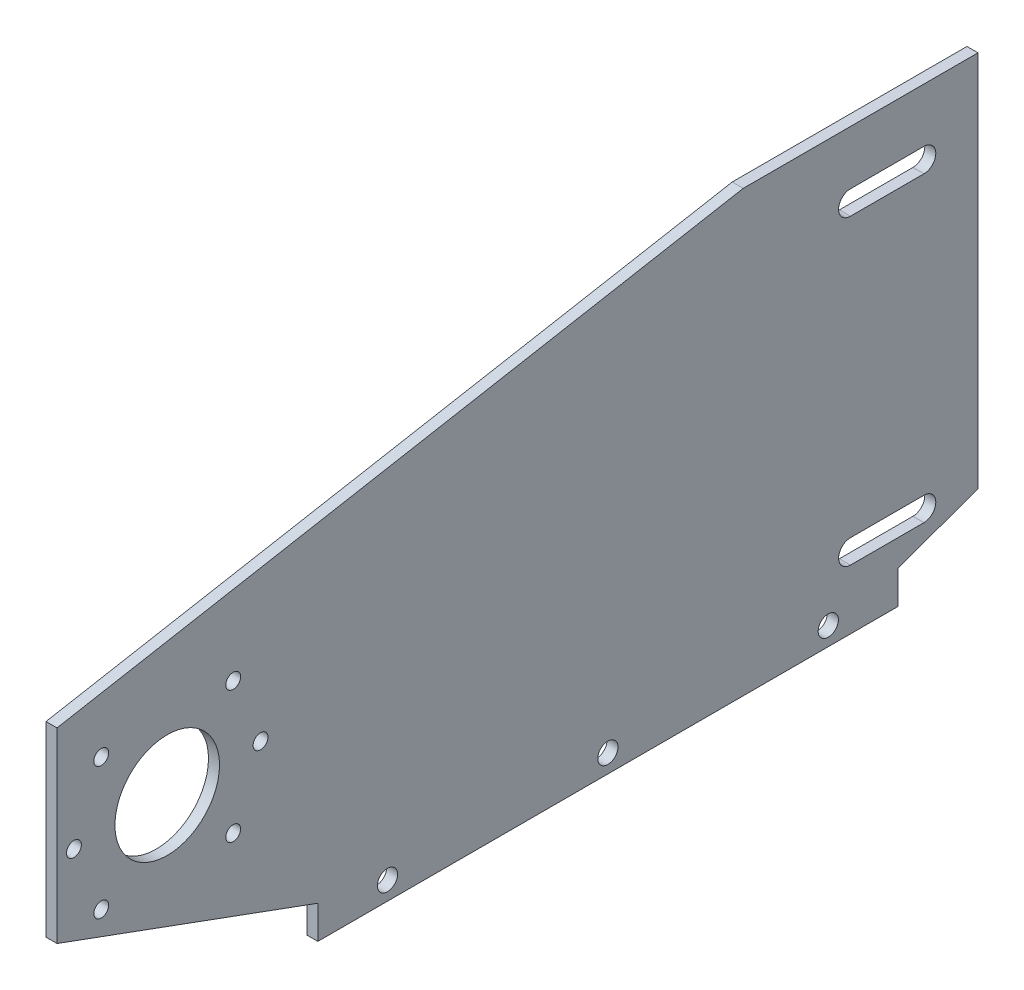
ISO-10303-21;
HEADER;
FILE_DESCRIPTION(('STEP AP214'),'2;1');
FILE_NAME('part.step','',(''),(''),'','','');
FILE_SCHEMA(('AUTOMOTIVE_DESIGN { 1 0 10303 214 1 1 1 1 }'));
ENDSEC;
DATA;
#1=APPLICATION_CONTEXT('core data for automotive mechanical design processes');
#2=APPLICATION_PROTOCOL_DEFINITION('international standard','automotive_design',2000,#1);
#3=PRODUCT_CONTEXT('',#1,'mechanical');
#4=PRODUCT('Part','Part','',(#3));
#5=PRODUCT_RELATED_PRODUCT_CATEGORY('part','',(#4));
#6=PRODUCT_DEFINITION_FORMATION('','',#4);
#7=PRODUCT_DEFINITION_CONTEXT('part definition',#1,'design');
#8=PRODUCT_DEFINITION('design','',#6,#7);
#9=PRODUCT_DEFINITION_SHAPE('','',#8);
#10=(LENGTH_UNIT() NAMED_UNIT(*) SI_UNIT(.MILLI.,.METRE.));
#11=(NAMED_UNIT(*) PLANE_ANGLE_UNIT() SI_UNIT($,.RADIAN.));
#12=(NAMED_UNIT(*) SI_UNIT($,.STERADIAN.) SOLID_ANGLE_UNIT());
#13=UNCERTAINTY_MEASURE_WITH_UNIT(LENGTH_MEASURE(1.E-05),#10,'distance_accuracy_value','');
#14=(GEOMETRIC_REPRESENTATION_CONTEXT(3) GLOBAL_UNCERTAINTY_ASSIGNED_CONTEXT((#13)) GLOBAL_UNIT_ASSIGNED_CONTEXT((#10,
#11,#12)) REPRESENTATION_CONTEXT('',''));
#15=CARTESIAN_POINT('',(0.,0.,0.));
#16=DIRECTION('',(0.,0.,1.));
#17=DIRECTION('',(1.,0.,0.));
#18=AXIS2_PLACEMENT_3D('',#15,#16,#17);
#19=CARTESIAN_POINT('',(3.,0.,0.));
#20=DIRECTION('',(0.,1.,0.));
#21=DIRECTION('',(0.,0.,1.));
#22=AXIS2_PLACEMENT_3D('',#19,#20,#21);
#23=PLANE('',#22);
#24=DIRECTION('',(-1.,0.,0.));
#25=VECTOR('',#24,1.);
#26=CARTESIAN_POINT('',(10.,0.,-228.924032369998));
#27=LINE('',#26,#25);
#28=CARTESIAN_POINT('',(3.,0.,-228.924032369998));
#29=VERTEX_POINT('',#28);
#30=CARTESIAN_POINT('',(0.,0.,-228.924032369998));
#31=VERTEX_POINT('',#30);
#32=EDGE_CURVE('E168',#29,#31,#27,.T.);
#33=ORIENTED_EDGE('',*,*,#32,.F.);
#34=DIRECTION('',(0.,0.,-1.));
#35=VECTOR('',#34,1.);
#36=CARTESIAN_POINT('',(3.,0.,0.));
#37=LINE('',#36,#35);
#38=CARTESIAN_POINT('',(3.,-1.04083408558608E-13,-71.0000000000003));
#39=VERTEX_POINT('',#38);
#40=EDGE_CURVE('E190',#39,#29,#37,.T.);
#41=ORIENTED_EDGE('',*,*,#40,.F.);
#42=DIRECTION('',(-1.,0.,0.));
#43=VECTOR('',#42,1.);
#44=CARTESIAN_POINT('',(3.,-1.04083408558608E-13,-71.0000000000003));
#45=LINE('',#44,#43);
#46=CARTESIAN_POINT('',(0.,0.,-71.0000000000003));
#47=VERTEX_POINT('',#46);
#48=EDGE_CURVE('E204',#39,#47,#45,.T.);
#49=ORIENTED_EDGE('',*,*,#48,.T.);
#50=DIRECTION('',(0.,0.,-1.));
#51=VECTOR('',#50,1.);
#52=CARTESIAN_POINT('',(0.,0.,0.));
#53=LINE('',#52,#51);
#54=EDGE_CURVE('E328',#47,#31,#53,.T.);
#55=ORIENTED_EDGE('',*,*,#54,.T.);
#56=EDGE_LOOP('',(#33,#41,#49,#55));
#57=FACE_BOUND('',#56,.T.);
#58=ADVANCED_FACE('F39',(#57),#23,.F.);
#59=CARTESIAN_POINT('',(3.,0.,0.));
#60=DIRECTION('',(-1.,0.,0.));
#61=DIRECTION('',(0.,0.,1.));
#62=AXIS2_PLACEMENT_3D('',#59,#60,#61);
#63=PLANE('',#62);
#64=CARTESIAN_POINT('',(3.,5.,-89.9620161849994));
#65=DIRECTION('',(1.,0.,0.));
#66=DIRECTION('',(0.,0.,-1.));
#67=AXIS2_PLACEMENT_3D('',#64,#65,#66);
#68=CIRCLE('',#67,2.74999999999961);
#69=CARTESIAN_POINT('',(3.,5.,-92.712016184999));
#70=VERTEX_POINT('',#69);
#71=EDGE_CURVE('E603',#70,#70,#68,.T.);
#72=ORIENTED_EDGE('',*,*,#71,.F.);
#73=EDGE_LOOP('',(#72));
#74=FACE_BOUND('',#73,.T.);
#75=CARTESIAN_POINT('',(3.,5.,-149.962016184999));
#76=DIRECTION('',(1.,0.,0.));
#77=DIRECTION('',(0.,0.,-1.));
#78=AXIS2_PLACEMENT_3D('',#75,#76,#77);
#79=CIRCLE('',#78,2.74999999999964);
#80=CARTESIAN_POINT('',(3.,5.,-152.712016184999));
#81=VERTEX_POINT('',#80);
#82=EDGE_CURVE('E606',#81,#81,#79,.T.);
#83=ORIENTED_EDGE('',*,*,#82,.F.);
#84=EDGE_LOOP('',(#83));
#85=FACE_BOUND('',#84,.T.);
#86=CARTESIAN_POINT('',(3.,4.99999999999995,-209.962016184999));
#87=DIRECTION('',(1.,0.,0.));
#88=DIRECTION('',(0.,0.,-1.));
#89=AXIS2_PLACEMENT_3D('',#86,#87,#88);
#90=CIRCLE('',#89,2.74999999999964);
#91=CARTESIAN_POINT('',(3.,4.99999999999995,-212.712016184999));
#92=VERTEX_POINT('',#91);
#93=EDGE_CURVE('E611',#92,#92,#90,.T.);
#94=ORIENTED_EDGE('',*,*,#93,.F.);
#95=EDGE_LOOP('',(#94));
#96=FACE_BOUND('',#95,.T.);
#97=CARTESIAN_POINT('',(3.,55.,-30.));
#98=DIRECTION('',(1.,0.,0.));
#99=DIRECTION('',(0.,0.,-1.));
#100=AXIS2_PLACEMENT_3D('',#97,#98,#99);
#101=CIRCLE('',#100,14.235);
#102=CARTESIAN_POINT('',(3.,55.,-44.235));
#103=VERTEX_POINT('',#102);
#104=EDGE_CURVE('E316',#103,#103,#101,.T.);
#105=ORIENTED_EDGE('',*,*,#104,.F.);
#106=EDGE_LOOP('',(#105));
#107=FACE_BOUND('',#106,.T.);
#108=DIRECTION('',(0.,0.,1.));
#109=VECTOR('',#108,1.);
#110=CARTESIAN_POINT('',(3.,104.938413591154,-236.));
#111=LINE('',#110,#109);
#112=CARTESIAN_POINT('',(3.,104.938413591154,-236.));
#113=VERTEX_POINT('',#112);
#114=CARTESIAN_POINT('',(3.,104.938413591154,-216.));
#115=VERTEX_POINT('',#114);
#116=EDGE_CURVE('E290',#113,#115,#111,.T.);
#117=ORIENTED_EDGE('',*,*,#116,.F.);
#118=CARTESIAN_POINT('',(3.,101.708413591154,-236.));
#119=DIRECTION('',(-1.,0.,0.));
#120=DIRECTION('',(0.,0.,1.));
#121=AXIS2_PLACEMENT_3D('',#118,#119,#120);
#122=CIRCLE('',#121,3.22999999999997);
#123=CARTESIAN_POINT('',(3.,98.4784135911545,-236.));
#124=VERTEX_POINT('',#123);
#125=EDGE_CURVE('E292',#124,#113,#122,.F.);
#126=ORIENTED_EDGE('',*,*,#125,.F.);
#127=DIRECTION('',(0.,0.,-1.));
#128=VECTOR('',#127,1.);
#129=CARTESIAN_POINT('',(3.,98.4784135911545,-216.));
#130=LINE('',#129,#128);
#131=CARTESIAN_POINT('',(3.,98.4784135911545,-216.));
#132=VERTEX_POINT('',#131);
#133=EDGE_CURVE('E307',#132,#124,#130,.T.);
#134=ORIENTED_EDGE('',*,*,#133,.F.);
#135=CARTESIAN_POINT('',(3.,101.708413591154,-216.));
#136=DIRECTION('',(-1.,0.,0.));
#137=DIRECTION('',(0.,0.,1.));
#138=AXIS2_PLACEMENT_3D('',#135,#136,#137);
#139=CIRCLE('',#138,3.22999999999997);
#140=EDGE_CURVE('E289',#115,#132,#139,.F.);
#141=ORIENTED_EDGE('',*,*,#140,.F.);
#142=EDGE_LOOP('',(#117,#126,#134,#141));
#143=FACE_BOUND('',#142,.T.);
#144=DIRECTION('',(0.,0.,-1.));
#145=VECTOR('',#144,1.);
#146=CARTESIAN_POINT('',(3.,16.2316943557674,-216.));
#147=LINE('',#146,#145);
#148=CARTESIAN_POINT('',(3.,16.2316943557674,-216.));
#149=VERTEX_POINT('',#148);
#150=CARTESIAN_POINT('',(3.,16.2316943557674,-236.));
#151=VERTEX_POINT('',#150);
#152=EDGE_CURVE('E285',#149,#151,#147,.T.);
#153=ORIENTED_EDGE('',*,*,#152,.F.);
#154=CARTESIAN_POINT('',(3.,19.4566943557674,-216.));
#155=DIRECTION('',(-1.,0.,0.));
#156=DIRECTION('',(0.,0.,1.));
#157=AXIS2_PLACEMENT_3D('',#154,#155,#156);
#158=CIRCLE('',#157,3.225);
#159=CARTESIAN_POINT('',(3.,22.6816943557674,-216.));
#160=VERTEX_POINT('',#159);
#161=EDGE_CURVE('E276',#160,#149,#158,.F.);
#162=ORIENTED_EDGE('',*,*,#161,.F.);
#163=DIRECTION('',(0.,0.,1.));
#164=VECTOR('',#163,1.);
#165=CARTESIAN_POINT('',(3.,22.6816943557674,-236.));
#166=LINE('',#165,#164);
#167=CARTESIAN_POINT('',(3.,22.6816943557674,-236.));
#168=VERTEX_POINT('',#167);
#169=EDGE_CURVE('E251',#168,#160,#166,.T.);
#170=ORIENTED_EDGE('',*,*,#169,.F.);
#171=CARTESIAN_POINT('',(3.,19.4566943557674,-236.));
#172=DIRECTION('',(-1.,0.,0.));
#173=DIRECTION('',(0.,0.,1.));
#174=AXIS2_PLACEMENT_3D('',#171,#172,#173);
#175=CIRCLE('',#174,3.225);
#176=EDGE_CURVE('E284',#151,#168,#175,.F.);
#177=ORIENTED_EDGE('',*,*,#176,.F.);
#178=EDGE_LOOP('',(#153,#162,#170,#177));
#179=FACE_BOUND('',#178,.T.);
#180=CARTESIAN_POINT('',(3.,37.0394877578616,-12.039487757861));
#181=DIRECTION('',(1.,0.,0.));
#182=DIRECTION('',(0.,0.,-1.));
#183=AXIS2_PLACEMENT_3D('',#180,#181,#182);
#184=CIRCLE('',#183,2.01930000000095);
#185=CARTESIAN_POINT('',(3.,37.0394877578616,-14.058787757862));
#186=VERTEX_POINT('',#185);
#187=EDGE_CURVE('E229',#186,#186,#184,.T.);
#188=ORIENTED_EDGE('',*,*,#187,.F.);
#189=EDGE_LOOP('',(#188));
#190=FACE_BOUND('',#189,.T.);
#191=CARTESIAN_POINT('',(3.,72.9605122421384,-47.9605122421375));
#192=DIRECTION('',(1.,0.,0.));
#193=DIRECTION('',(0.,0.,-1.));
#194=AXIS2_PLACEMENT_3D('',#191,#192,#193);
#195=CIRCLE('',#194,2.0193000000009);
#196=CARTESIAN_POINT('',(3.,72.9605122421384,-49.9798122421384));
#197=VERTEX_POINT('',#196);
#198=EDGE_CURVE('E223',#197,#197,#195,.T.);
#199=ORIENTED_EDGE('',*,*,#198,.F.);
#200=EDGE_LOOP('',(#199));
#201=FACE_BOUND('',#200,.T.);
#202=CARTESIAN_POINT('',(3.,55.,-55.3999999999992));
#203=DIRECTION('',(1.,0.,0.));
#204=DIRECTION('',(0.,0.,-1.));
#205=AXIS2_PLACEMENT_3D('',#202,#203,#204);
#206=CIRCLE('',#205,2.01930000000093);
#207=CARTESIAN_POINT('',(3.,55.,-57.4193000000002));
#208=VERTEX_POINT('',#207);
#209=EDGE_CURVE('E246',#208,#208,#206,.T.);
#210=ORIENTED_EDGE('',*,*,#209,.F.);
#211=EDGE_LOOP('',(#210));
#212=FACE_BOUND('',#211,.T.);
#213=CARTESIAN_POINT('',(3.,37.0394877578618,-47.9605122421376));
#214=DIRECTION('',(1.,0.,0.));
#215=DIRECTION('',(0.,0.,-1.));
#216=AXIS2_PLACEMENT_3D('',#213,#214,#215);
#217=CIRCLE('',#216,2.01930000000096);
#218=CARTESIAN_POINT('',(3.,37.0394877578618,-49.9798122421386));
#219=VERTEX_POINT('',#218);
#220=EDGE_CURVE('E239',#219,#219,#217,.T.);
#221=ORIENTED_EDGE('',*,*,#220,.F.);
#222=EDGE_LOOP('',(#221));
#223=FACE_BOUND('',#222,.T.);
#224=CARTESIAN_POINT('',(3.,55.,-4.59999999999925));
#225=DIRECTION('',(1.,0.,0.));
#226=DIRECTION('',(0.,0.,-1.));
#227=AXIS2_PLACEMENT_3D('',#224,#225,#226);
#228=CIRCLE('',#227,2.01930000000091);
#229=CARTESIAN_POINT('',(3.,55.,-6.61930000000016));
#230=VERTEX_POINT('',#229);
#231=EDGE_CURVE('E234',#230,#230,#228,.T.);
#232=ORIENTED_EDGE('',*,*,#231,.F.);
#233=EDGE_LOOP('',(#232));
#234=FACE_BOUND('',#233,.T.);
#235=CARTESIAN_POINT('',(3.,72.9605122421382,-12.0394877578609));
#236=DIRECTION('',(1.,0.,0.));
#237=DIRECTION('',(0.,0.,-1.));
#238=AXIS2_PLACEMENT_3D('',#235,#236,#237);
#239=CIRCLE('',#238,2.01930000000089);
#240=CARTESIAN_POINT('',(3.,72.9605122421382,-14.0587877578618));
#241=VERTEX_POINT('',#240);
#242=EDGE_CURVE('E227',#241,#241,#239,.T.);
#243=ORIENTED_EDGE('',*,*,#242,.F.);
#244=EDGE_LOOP('',(#243));
#245=FACE_BOUND('',#244,.T.);
#246=DIRECTION('',(0.,-1.,1.11022302462517E-13));
#247=VECTOR('',#246,1.);
#248=CARTESIAN_POINT('',(3.,-2.5415673162721E-11,-228.924032369998));
#249=LINE('',#248,#247);
#250=CARTESIAN_POINT('',(3.,8.99999999999977,-228.924032369999));
#251=VERTEX_POINT('',#250);
#252=EDGE_CURVE('E11',#251,#29,#249,.T.);
#253=ORIENTED_EDGE('',*,*,#252,.F.);
#254=DIRECTION('',(0.,-0.339870380460165,0.940472287994635));
#255=VECTOR('',#254,1.);
#256=CARTESIAN_POINT('',(3.,-65.2125811093336,-23.5666962603209));
#257=LINE('',#256,#255);
#258=CARTESIAN_POINT('',(3.,16.8759471545118,-250.717958720686));
#259=VERTEX_POINT('',#258);
#260=EDGE_CURVE('E183',#259,#251,#257,.T.);
#261=ORIENTED_EDGE('',*,*,#260,.F.);
#262=DIRECTION('',(0.,-1.,0.));
#263=VECTOR('',#262,1.);
#264=CARTESIAN_POINT('',(3.,8.41583918198635E-13,-250.717958720686));
#265=LINE('',#264,#263);
#266=CARTESIAN_POINT('',(3.,119.641480315501,-250.717958720685));
#267=VERTEX_POINT('',#266);
#268=EDGE_CURVE('E50',#267,#259,#265,.T.);
#269=ORIENTED_EDGE('',*,*,#268,.F.);
#270=DIRECTION('',(0.,0.,1.));
#271=VECTOR('',#270,1.);
#272=CARTESIAN_POINT('',(3.,119.641480315501,-186.802640374282));
#273=LINE('',#272,#271);
#274=CARTESIAN_POINT('',(3.,119.641480315501,-186.802640374282));
#275=VERTEX_POINT('',#274);
#276=EDGE_CURVE('E216',#267,#275,#273,.T.);
#277=ORIENTED_EDGE('',*,*,#276,.T.);
#278=DIRECTION('',(0.,-0.178012042619946,0.984028308882562));
#279=VECTOR('',#278,1.);
#280=CARTESIAN_POINT('',(3.,85.8486317971625,-3.88578058618805E-13));
#281=LINE('',#280,#279);
#282=CARTESIAN_POINT('',(3.,85.8486317971625,-3.88578058618805E-13));
#283=VERTEX_POINT('',#282);
#284=EDGE_CURVE('E212',#275,#283,#281,.T.);
#285=ORIENTED_EDGE('',*,*,#284,.T.);
#286=DIRECTION('',(0.,-1.,0.));
#287=VECTOR('',#286,1.);
#288=CARTESIAN_POINT('',(3.,0.,0.));
#289=LINE('',#288,#287);
#290=CARTESIAN_POINT('',(3.,34.9999999999999,-2.22044604925031E-13));
#291=VERTEX_POINT('',#290);
#292=EDGE_CURVE('E323',#283,#291,#289,.T.);
#293=ORIENTED_EDGE('',*,*,#292,.T.);
#294=DIRECTION('',(0.,-0.343866011956347,-0.939018724957728));
#295=VECTOR('',#294,1.);
#296=CARTESIAN_POINT('',(3.,8.99999999999983,-71.0000000000012));
#297=LINE('',#296,#295);
#298=CARTESIAN_POINT('',(3.,8.99999999999983,-71.0000000000012));
#299=VERTEX_POINT('',#298);
#300=EDGE_CURVE('E192',#291,#299,#297,.T.);
#301=ORIENTED_EDGE('',*,*,#300,.T.);
#302=DIRECTION('',(0.,-1.,1.07938349616336E-13));
#303=VECTOR('',#302,1.);
#304=CARTESIAN_POINT('',(3.,-1.04083408558608E-13,-71.0000000000003));
#305=LINE('',#304,#303);
#306=EDGE_CURVE('E191',#299,#39,#305,.T.);
#307=ORIENTED_EDGE('',*,*,#306,.T.);
#308=ORIENTED_EDGE('',*,*,#40,.T.);
#309=EDGE_LOOP('',(#253,#261,#269,#277,#285,#293,#301,#307,#308));
#310=FACE_BOUND('',#309,.T.);
#311=ADVANCED_FACE('F347',(#74,#85,#96,#107,#143,#179,#190,#201,#212,#223,#234,#245,#310),#63,.F.);
#312=CARTESIAN_POINT('',(0.,0.,0.));
#313=DIRECTION('',(-1.,0.,0.));
#314=DIRECTION('',(0.,0.,1.));
#315=AXIS2_PLACEMENT_3D('',#312,#313,#314);
#316=PLANE('',#315);
#317=CARTESIAN_POINT('',(0.,5.,-89.9620161849994));
#318=DIRECTION('',(1.,0.,0.));
#319=DIRECTION('',(0.,0.,-1.));
#320=AXIS2_PLACEMENT_3D('',#317,#318,#319);
#321=CIRCLE('',#320,2.74999999999961);
#322=CARTESIAN_POINT('',(0.,5.,-92.712016184999));
#323=VERTEX_POINT('',#322);
#324=EDGE_CURVE('E173',#323,#323,#321,.T.);
#325=ORIENTED_EDGE('',*,*,#324,.T.);
#326=EDGE_LOOP('',(#325));
#327=FACE_BOUND('',#326,.T.);
#328=CARTESIAN_POINT('',(0.,5.,-149.962016184999));
#329=DIRECTION('',(1.,0.,0.));
#330=DIRECTION('',(0.,0.,-1.));
#331=AXIS2_PLACEMENT_3D('',#328,#329,#330);
#332=CIRCLE('',#331,2.74999999999964);
#333=CARTESIAN_POINT('',(0.,5.,-152.712016184999));
#334=VERTEX_POINT('',#333);
#335=EDGE_CURVE('E609',#334,#334,#332,.T.);
#336=ORIENTED_EDGE('',*,*,#335,.T.);
#337=EDGE_LOOP('',(#336));
#338=FACE_BOUND('',#337,.T.);
#339=CARTESIAN_POINT('',(0.,4.99999999999995,-209.962016184999));
#340=DIRECTION('',(1.,0.,0.));
#341=DIRECTION('',(0.,0.,-1.));
#342=AXIS2_PLACEMENT_3D('',#339,#340,#341);
#343=CIRCLE('',#342,2.74999999999964);
#344=CARTESIAN_POINT('',(0.,4.99999999999995,-212.712016184999));
#345=VERTEX_POINT('',#344);
#346=EDGE_CURVE('E617',#345,#345,#343,.T.);
#347=ORIENTED_EDGE('',*,*,#346,.T.);
#348=EDGE_LOOP('',(#347));
#349=FACE_BOUND('',#348,.T.);
#350=CARTESIAN_POINT('',(0.,72.9605122421382,-12.0394877578609));
#351=DIRECTION('',(1.,0.,0.));
#352=DIRECTION('',(0.,0.,-1.));
#353=AXIS2_PLACEMENT_3D('',#350,#351,#352);
#354=CIRCLE('',#353,2.01930000000089);
#355=CARTESIAN_POINT('',(0.,72.9605122421382,-14.0587877578618));
#356=VERTEX_POINT('',#355);
#357=EDGE_CURVE('E233',#356,#356,#354,.T.);
#358=ORIENTED_EDGE('',*,*,#357,.T.);
#359=EDGE_LOOP('',(#358));
#360=FACE_BOUND('',#359,.T.);
#361=CARTESIAN_POINT('',(0.,55.,-4.59999999999925));
#362=DIRECTION('',(1.,0.,0.));
#363=DIRECTION('',(0.,0.,-1.));
#364=AXIS2_PLACEMENT_3D('',#361,#362,#363);
#365=CIRCLE('',#364,2.01930000000091);
#366=CARTESIAN_POINT('',(0.,55.,-6.61930000000016));
#367=VERTEX_POINT('',#366);
#368=EDGE_CURVE('E240',#367,#367,#365,.T.);
#369=ORIENTED_EDGE('',*,*,#368,.T.);
#370=EDGE_LOOP('',(#369));
#371=FACE_BOUND('',#370,.T.);
#372=CARTESIAN_POINT('',(0.,37.0394877578618,-47.9605122421376));
#373=DIRECTION('',(1.,0.,0.));
#374=DIRECTION('',(0.,0.,-1.));
#375=AXIS2_PLACEMENT_3D('',#372,#373,#374);
#376=CIRCLE('',#375,2.01930000000096);
#377=CARTESIAN_POINT('',(0.,37.0394877578618,-49.9798122421386));
#378=VERTEX_POINT('',#377);
#379=EDGE_CURVE('E243',#378,#378,#376,.T.);
#380=ORIENTED_EDGE('',*,*,#379,.T.);
#381=EDGE_LOOP('',(#380));
#382=FACE_BOUND('',#381,.T.);
#383=CARTESIAN_POINT('',(0.,55.,-55.3999999999992));
#384=DIRECTION('',(1.,0.,0.));
#385=DIRECTION('',(0.,0.,-1.));
#386=AXIS2_PLACEMENT_3D('',#383,#384,#385);
#387=CIRCLE('',#386,2.01930000000093);
#388=CARTESIAN_POINT('',(0.,55.,-57.4193000000002));
#389=VERTEX_POINT('',#388);
#390=EDGE_CURVE('E225',#389,#389,#387,.T.);
#391=ORIENTED_EDGE('',*,*,#390,.T.);
#392=EDGE_LOOP('',(#391));
#393=FACE_BOUND('',#392,.T.);
#394=CARTESIAN_POINT('',(0.,72.9605122421384,-47.9605122421375));
#395=DIRECTION('',(1.,0.,0.));
#396=DIRECTION('',(0.,0.,-1.));
#397=AXIS2_PLACEMENT_3D('',#394,#395,#396);
#398=CIRCLE('',#397,2.0193000000009);
#399=CARTESIAN_POINT('',(0.,72.9605122421384,-49.9798122421384));
#400=VERTEX_POINT('',#399);
#401=EDGE_CURVE('E205',#400,#400,#398,.T.);
#402=ORIENTED_EDGE('',*,*,#401,.T.);
#403=EDGE_LOOP('',(#402));
#404=FACE_BOUND('',#403,.T.);
#405=CARTESIAN_POINT('',(0.,37.0394877578616,-12.039487757861));
#406=DIRECTION('',(1.,0.,0.));
#407=DIRECTION('',(0.,0.,-1.));
#408=AXIS2_PLACEMENT_3D('',#405,#406,#407);
#409=CIRCLE('',#408,2.01930000000095);
#410=CARTESIAN_POINT('',(0.,37.0394877578616,-14.058787757862));
#411=VERTEX_POINT('',#410);
#412=EDGE_CURVE('E252',#411,#411,#409,.T.);
#413=ORIENTED_EDGE('',*,*,#412,.T.);
#414=EDGE_LOOP('',(#413));
#415=FACE_BOUND('',#414,.T.);
#416=CARTESIAN_POINT('',(0.,19.4566943557674,-216.));
#417=DIRECTION('',(-1.,0.,0.));
#418=DIRECTION('',(0.,0.,1.));
#419=AXIS2_PLACEMENT_3D('',#416,#417,#418);
#420=CIRCLE('',#419,3.225);
#421=CARTESIAN_POINT('',(0.,16.2316943557674,-216.));
#422=VERTEX_POINT('',#421);
#423=CARTESIAN_POINT('',(0.,22.6816943557674,-216.));
#424=VERTEX_POINT('',#423);
#425=EDGE_CURVE('E279',#422,#424,#420,.T.);
#426=ORIENTED_EDGE('',*,*,#425,.F.);
#427=DIRECTION('',(0.,0.,1.));
#428=VECTOR('',#427,1.);
#429=CARTESIAN_POINT('',(0.,16.2316943557674,-216.));
#430=LINE('',#429,#428);
#431=CARTESIAN_POINT('',(0.,16.2316943557674,-236.));
#432=VERTEX_POINT('',#431);
#433=EDGE_CURVE('E263',#432,#422,#430,.T.);
#434=ORIENTED_EDGE('',*,*,#433,.F.);
#435=CARTESIAN_POINT('',(0.,19.4566943557674,-236.));
#436=DIRECTION('',(-1.,0.,0.));
#437=DIRECTION('',(0.,0.,1.));
#438=AXIS2_PLACEMENT_3D('',#435,#436,#437);
#439=CIRCLE('',#438,3.225);
#440=CARTESIAN_POINT('',(0.,22.6816943557674,-236.));
#441=VERTEX_POINT('',#440);
#442=EDGE_CURVE('E272',#441,#432,#439,.T.);
#443=ORIENTED_EDGE('',*,*,#442,.F.);
#444=DIRECTION('',(0.,0.,-1.));
#445=VECTOR('',#444,1.);
#446=CARTESIAN_POINT('',(0.,22.6816943557674,-236.));
#447=LINE('',#446,#445);
#448=EDGE_CURVE('E274',#424,#441,#447,.T.);
#449=ORIENTED_EDGE('',*,*,#448,.F.);
#450=EDGE_LOOP('',(#426,#434,#443,#449));
#451=FACE_BOUND('',#450,.T.);
#452=CARTESIAN_POINT('',(0.,101.708413591154,-236.));
#453=DIRECTION('',(-1.,0.,0.));
#454=DIRECTION('',(0.,0.,1.));
#455=AXIS2_PLACEMENT_3D('',#452,#453,#454);
#456=CIRCLE('',#455,3.22999999999997);
#457=CARTESIAN_POINT('',(0.,104.938413591154,-236.));
#458=VERTEX_POINT('',#457);
#459=CARTESIAN_POINT('',(0.,98.4784135911545,-236.));
#460=VERTEX_POINT('',#459);
#461=EDGE_CURVE('E294',#458,#460,#456,.T.);
#462=ORIENTED_EDGE('',*,*,#461,.F.);
#463=DIRECTION('',(0.,0.,-1.));
#464=VECTOR('',#463,1.);
#465=CARTESIAN_POINT('',(0.,104.938413591154,-236.));
#466=LINE('',#465,#464);
#467=CARTESIAN_POINT('',(0.,104.938413591154,-216.));
#468=VERTEX_POINT('',#467);
#469=EDGE_CURVE('E303',#468,#458,#466,.T.);
#470=ORIENTED_EDGE('',*,*,#469,.F.);
#471=CARTESIAN_POINT('',(0.,101.708413591154,-216.));
#472=DIRECTION('',(-1.,0.,0.));
#473=DIRECTION('',(0.,0.,1.));
#474=AXIS2_PLACEMENT_3D('',#471,#472,#473);
#475=CIRCLE('',#474,3.22999999999997);
#476=CARTESIAN_POINT('',(0.,98.4784135911545,-216.));
#477=VERTEX_POINT('',#476);
#478=EDGE_CURVE('E297',#477,#468,#475,.T.);
#479=ORIENTED_EDGE('',*,*,#478,.F.);
#480=DIRECTION('',(0.,0.,1.));
#481=VECTOR('',#480,1.);
#482=CARTESIAN_POINT('',(0.,98.4784135911545,-216.));
#483=LINE('',#482,#481);
#484=EDGE_CURVE('E300',#460,#477,#483,.T.);
#485=ORIENTED_EDGE('',*,*,#484,.F.);
#486=EDGE_LOOP('',(#462,#470,#479,#485));
#487=FACE_BOUND('',#486,.T.);
#488=CARTESIAN_POINT('',(0.,55.,-30.));
#489=DIRECTION('',(1.,0.,0.));
#490=DIRECTION('',(0.,0.,-1.));
#491=AXIS2_PLACEMENT_3D('',#488,#489,#490);
#492=CIRCLE('',#491,14.235);
#493=CARTESIAN_POINT('',(0.,55.,-44.235));
#494=VERTEX_POINT('',#493);
#495=EDGE_CURVE('E319',#494,#494,#492,.T.);
#496=ORIENTED_EDGE('',*,*,#495,.T.);
#497=EDGE_LOOP('',(#496));
#498=FACE_BOUND('',#497,.T.);
#499=DIRECTION('',(0.,0.,1.));
#500=VECTOR('',#499,1.);
#501=CARTESIAN_POINT('',(0.,119.641480315501,-186.802640374282));
#502=LINE('',#501,#500);
#503=CARTESIAN_POINT('',(0.,119.641480315501,-250.717958720685));
#504=VERTEX_POINT('',#503);
#505=CARTESIAN_POINT('',(0.,119.641480315501,-186.802640374282));
#506=VERTEX_POINT('',#505);
#507=EDGE_CURVE('E178',#504,#506,#502,.T.);
#508=ORIENTED_EDGE('',*,*,#507,.F.);
#509=DIRECTION('',(0.,-1.,0.));
#510=VECTOR('',#509,1.);
#511=CARTESIAN_POINT('',(0.,8.41583918198635E-13,-250.717958720686));
#512=LINE('',#511,#510);
#513=CARTESIAN_POINT('',(0.,16.8759471545118,-250.717958720686));
#514=VERTEX_POINT('',#513);
#515=EDGE_CURVE('E163',#504,#514,#512,.T.);
#516=ORIENTED_EDGE('',*,*,#515,.T.);
#517=DIRECTION('',(0.,-0.339870380460165,0.940472287994635));
#518=VECTOR('',#517,1.);
#519=CARTESIAN_POINT('',(0.,-65.2125811093336,-23.5666962603209));
#520=LINE('',#519,#518);
#521=CARTESIAN_POINT('',(0.,8.99999999999977,-228.924032369999));
#522=VERTEX_POINT('',#521);
#523=EDGE_CURVE('E169',#514,#522,#520,.T.);
#524=ORIENTED_EDGE('',*,*,#523,.T.);
#525=DIRECTION('',(0.,-1.,1.11022302462517E-13));
#526=VECTOR('',#525,1.);
#527=CARTESIAN_POINT('',(0.,-2.5415673162721E-11,-228.924032369998));
#528=LINE('',#527,#526);
#529=EDGE_CURVE('E53',#522,#31,#528,.T.);
#530=ORIENTED_EDGE('',*,*,#529,.T.);
#531=ORIENTED_EDGE('',*,*,#54,.F.);
#532=DIRECTION('',(0.,-1.,1.07938349616336E-13));
#533=VECTOR('',#532,1.);
#534=CARTESIAN_POINT('',(0.,-1.04083408558608E-13,-71.0000000000003));
#535=LINE('',#534,#533);
#536=CARTESIAN_POINT('',(0.,8.99999999999983,-71.0000000000012));
#537=VERTEX_POINT('',#536);
#538=EDGE_CURVE('E64',#537,#47,#535,.T.);
#539=ORIENTED_EDGE('',*,*,#538,.F.);
#540=DIRECTION('',(0.,-0.343866011956347,-0.939018724957728));
#541=VECTOR('',#540,1.);
#542=CARTESIAN_POINT('',(0.,8.99999999999983,-71.0000000000012));
#543=LINE('',#542,#541);
#544=CARTESIAN_POINT('',(0.,34.9999999999999,-2.22044604925031E-13));
#545=VERTEX_POINT('',#544);
#546=EDGE_CURVE('E198',#545,#537,#543,.T.);
#547=ORIENTED_EDGE('',*,*,#546,.F.);
#548=DIRECTION('',(0.,-1.,0.));
#549=VECTOR('',#548,1.);
#550=CARTESIAN_POINT('',(0.,0.,0.));
#551=LINE('',#550,#549);
#552=CARTESIAN_POINT('',(0.,85.8486317971625,-3.88578058618805E-13));
#553=VERTEX_POINT('',#552);
#554=EDGE_CURVE('E324',#553,#545,#551,.T.);
#555=ORIENTED_EDGE('',*,*,#554,.F.);
#556=DIRECTION('',(0.,-0.178012042619946,0.984028308882562));
#557=VECTOR('',#556,1.);
#558=CARTESIAN_POINT('',(0.,85.8486317971625,-3.88578058618805E-13));
#559=LINE('',#558,#557);
#560=EDGE_CURVE('E211',#506,#553,#559,.T.);
#561=ORIENTED_EDGE('',*,*,#560,.F.);
#562=EDGE_LOOP('',(#508,#516,#524,#530,#531,#539,#547,#555,#561));
#563=FACE_BOUND('',#562,.T.);
#564=ADVANCED_FACE('F176',(#327,#338,#349,#360,#371,#382,#393,#404,#415,#451,#487,#498,#563),
#316,.T.);
#565=CARTESIAN_POINT('',(3.,0.,0.));
#566=DIRECTION('',(0.,0.,-1.));
#567=DIRECTION('',(-1.,0.,0.));
#568=AXIS2_PLACEMENT_3D('',#565,#566,#567);
#569=PLANE('',#568);
#570=DIRECTION('',(-1.,0.,0.));
#571=VECTOR('',#570,1.);
#572=CARTESIAN_POINT('',(3.,34.9999999999999,-2.22044604925031E-13));
#573=LINE('',#572,#571);
#574=EDGE_CURVE('E200',#291,#545,#573,.T.);
#575=ORIENTED_EDGE('',*,*,#574,.F.);
#576=ORIENTED_EDGE('',*,*,#292,.F.);
#577=DIRECTION('',(-1.,0.,0.));
#578=VECTOR('',#577,1.);
#579=CARTESIAN_POINT('',(3.,85.8486317971625,-3.88578058618805E-13));
#580=LINE('',#579,#578);
#581=EDGE_CURVE('E188',#283,#553,#580,.T.);
#582=ORIENTED_EDGE('',*,*,#581,.T.);
#583=ORIENTED_EDGE('',*,*,#554,.T.);
#584=EDGE_LOOP('',(#575,#576,#582,#583));
#585=FACE_BOUND('',#584,.T.);
#586=ADVANCED_FACE('F41',(#585),#569,.F.);
#587=CARTESIAN_POINT('',(3.,55.,-30.));
#588=DIRECTION('',(-1.,0.,0.));
#589=DIRECTION('',(0.,0.,1.));
#590=AXIS2_PLACEMENT_3D('',#587,#588,#589);
#591=CYLINDRICAL_SURFACE('',#590,14.235);
#592=ORIENTED_EDGE('',*,*,#104,.T.);
#593=EDGE_LOOP('',(#592));
#594=FACE_BOUND('',#593,.T.);
#595=ORIENTED_EDGE('',*,*,#495,.F.);
#596=EDGE_LOOP('',(#595));
#597=FACE_BOUND('',#596,.T.);
#598=ADVANCED_FACE('F378',(#594,#597),#591,.F.);
#599=CARTESIAN_POINT('',(3.001,101.708413591154,-236.));
#600=DIRECTION('',(-1.,0.,0.));
#601=DIRECTION('',(0.,0.,1.));
#602=AXIS2_PLACEMENT_3D('',#599,#600,#601);
#603=CYLINDRICAL_SURFACE('',#602,3.22999999999997);
#604=ORIENTED_EDGE('',*,*,#125,.T.);
#605=DIRECTION('',(-1.,0.,0.));
#606=VECTOR('',#605,1.);
#607=CARTESIAN_POINT('',(3.001,104.938413591154,-236.));
#608=LINE('',#607,#606);
#609=EDGE_CURVE('E310',#113,#458,#608,.T.);
#610=ORIENTED_EDGE('',*,*,#609,.T.);
#611=ORIENTED_EDGE('',*,*,#461,.T.);
#612=DIRECTION('',(-1.,0.,0.));
#613=VECTOR('',#612,1.);
#614=CARTESIAN_POINT('',(3.001,98.4784135911545,-236.));
#615=LINE('',#614,#613);
#616=EDGE_CURVE('E306',#124,#460,#615,.T.);
#617=ORIENTED_EDGE('',*,*,#616,.F.);
#618=EDGE_LOOP('',(#604,#610,#611,#617));
#619=FACE_BOUND('',#618,.T.);
#620=ADVANCED_FACE('F385',(#619),#603,.F.);
#621=CARTESIAN_POINT('',(3.001,104.938413591154,-236.));
#622=DIRECTION('',(0.,1.,0.));
#623=DIRECTION('',(0.,0.,1.));
#624=AXIS2_PLACEMENT_3D('',#621,#622,#623);
#625=PLANE('',#624);
#626=ORIENTED_EDGE('',*,*,#116,.T.);
#627=DIRECTION('',(-1.,0.,0.));
#628=VECTOR('',#627,1.);
#629=CARTESIAN_POINT('',(3.001,104.938413591154,-216.));
#630=LINE('',#629,#628);
#631=EDGE_CURVE('E309',#115,#468,#630,.T.);
#632=ORIENTED_EDGE('',*,*,#631,.T.);
#633=ORIENTED_EDGE('',*,*,#469,.T.);
#634=ORIENTED_EDGE('',*,*,#609,.F.);
#635=EDGE_LOOP('',(#626,#632,#633,#634));
#636=FACE_BOUND('',#635,.T.);
#637=ADVANCED_FACE('F387',(#636),#625,.F.);
#638=CARTESIAN_POINT('',(3.001,101.708413591154,-216.));
#639=DIRECTION('',(-1.,0.,0.));
#640=DIRECTION('',(0.,0.,1.));
#641=AXIS2_PLACEMENT_3D('',#638,#639,#640);
#642=CYLINDRICAL_SURFACE('',#641,3.22999999999997);
#643=ORIENTED_EDGE('',*,*,#140,.T.);
#644=DIRECTION('',(-1.,0.,0.));
#645=VECTOR('',#644,1.);
#646=CARTESIAN_POINT('',(3.001,98.4784135911545,-216.));
#647=LINE('',#646,#645);
#648=EDGE_CURVE('E315',#132,#477,#647,.T.);
#649=ORIENTED_EDGE('',*,*,#648,.T.);
#650=ORIENTED_EDGE('',*,*,#478,.T.);
#651=ORIENTED_EDGE('',*,*,#631,.F.);
#652=EDGE_LOOP('',(#643,#649,#650,#651));
#653=FACE_BOUND('',#652,.T.);
#654=ADVANCED_FACE('F395',(#653),#642,.F.);
#655=CARTESIAN_POINT('',(3.001,98.4784135911545,-216.));
#656=DIRECTION('',(0.,-1.,0.));
#657=DIRECTION('',(0.,0.,-1.));
#658=AXIS2_PLACEMENT_3D('',#655,#656,#657);
#659=PLANE('',#658);
#660=ORIENTED_EDGE('',*,*,#133,.T.);
#661=ORIENTED_EDGE('',*,*,#616,.T.);
#662=ORIENTED_EDGE('',*,*,#484,.T.);
#663=ORIENTED_EDGE('',*,*,#648,.F.);
#664=EDGE_LOOP('',(#660,#661,#662,#663));
#665=FACE_BOUND('',#664,.T.);
#666=ADVANCED_FACE('F390',(#665),#659,.F.);
#667=CARTESIAN_POINT('',(3.001,19.4566943557674,-216.));
#668=DIRECTION('',(-1.,0.,0.));
#669=DIRECTION('',(0.,0.,1.));
#670=AXIS2_PLACEMENT_3D('',#667,#668,#669);
#671=CYLINDRICAL_SURFACE('',#670,3.225);
#672=ORIENTED_EDGE('',*,*,#161,.T.);
#673=DIRECTION('',(-1.,0.,0.));
#674=VECTOR('',#673,1.);
#675=CARTESIAN_POINT('',(3.001,16.2316943557674,-216.));
#676=LINE('',#675,#674);
#677=EDGE_CURVE('E256',#149,#422,#676,.T.);
#678=ORIENTED_EDGE('',*,*,#677,.T.);
#679=ORIENTED_EDGE('',*,*,#425,.T.);
#680=DIRECTION('',(-1.,0.,0.));
#681=VECTOR('',#680,1.);
#682=CARTESIAN_POINT('',(3.001,22.6816943557674,-216.));
#683=LINE('',#682,#681);
#684=EDGE_CURVE('E258',#160,#424,#683,.T.);
#685=ORIENTED_EDGE('',*,*,#684,.F.);
#686=EDGE_LOOP('',(#672,#678,#679,#685));
#687=FACE_BOUND('',#686,.T.);
#688=ADVANCED_FACE('F391',(#687),#671,.F.);
#689=CARTESIAN_POINT('',(3.001,16.2316943557674,-216.));
#690=DIRECTION('',(0.,-1.,0.));
#691=DIRECTION('',(0.,0.,-1.));
#692=AXIS2_PLACEMENT_3D('',#689,#690,#691);
#693=PLANE('',#692);
#694=ORIENTED_EDGE('',*,*,#152,.T.);
#695=DIRECTION('',(-1.,0.,0.));
#696=VECTOR('',#695,1.);
#697=CARTESIAN_POINT('',(3.001,16.2316943557674,-236.));
#698=LINE('',#697,#696);
#699=EDGE_CURVE('E268',#151,#432,#698,.T.);
#700=ORIENTED_EDGE('',*,*,#699,.T.);
#701=ORIENTED_EDGE('',*,*,#433,.T.);
#702=ORIENTED_EDGE('',*,*,#677,.F.);
#703=EDGE_LOOP('',(#694,#700,#701,#702));
#704=FACE_BOUND('',#703,.T.);
#705=ADVANCED_FACE('F396',(#704),#693,.F.);
#706=CARTESIAN_POINT('',(3.001,19.4566943557674,-236.));
#707=DIRECTION('',(-1.,0.,0.));
#708=DIRECTION('',(0.,0.,1.));
#709=AXIS2_PLACEMENT_3D('',#706,#707,#708);
#710=CYLINDRICAL_SURFACE('',#709,3.225);
#711=ORIENTED_EDGE('',*,*,#176,.T.);
#712=DIRECTION('',(-1.,0.,0.));
#713=VECTOR('',#712,1.);
#714=CARTESIAN_POINT('',(3.001,22.6816943557674,-236.));
#715=LINE('',#714,#713);
#716=EDGE_CURVE('E262',#168,#441,#715,.T.);
#717=ORIENTED_EDGE('',*,*,#716,.T.);
#718=ORIENTED_EDGE('',*,*,#442,.T.);
#719=ORIENTED_EDGE('',*,*,#699,.F.);
#720=EDGE_LOOP('',(#711,#717,#718,#719));
#721=FACE_BOUND('',#720,.T.);
#722=ADVANCED_FACE('F401',(#721),#710,.F.);
#723=CARTESIAN_POINT('',(3.001,22.6816943557674,-236.));
#724=DIRECTION('',(0.,1.,0.));
#725=DIRECTION('',(0.,0.,1.));
#726=AXIS2_PLACEMENT_3D('',#723,#724,#725);
#727=PLANE('',#726);
#728=ORIENTED_EDGE('',*,*,#169,.T.);
#729=ORIENTED_EDGE('',*,*,#684,.T.);
#730=ORIENTED_EDGE('',*,*,#448,.T.);
#731=ORIENTED_EDGE('',*,*,#716,.F.);
#732=EDGE_LOOP('',(#728,#729,#730,#731));
#733=FACE_BOUND('',#732,.T.);
#734=ADVANCED_FACE('F409',(#733),#727,.F.);
#735=CARTESIAN_POINT('',(0.,37.0394877578616,-12.039487757861));
#736=DIRECTION('',(1.,0.,0.));
#737=DIRECTION('',(0.,0.,-1.));
#738=AXIS2_PLACEMENT_3D('',#735,#736,#737);
#739=CYLINDRICAL_SURFACE('',#738,2.01930000000095);
#740=ORIENTED_EDGE('',*,*,#412,.F.);
#741=EDGE_LOOP('',(#740));
#742=FACE_BOUND('',#741,.T.);
#743=ORIENTED_EDGE('',*,*,#187,.T.);
#744=EDGE_LOOP('',(#743));
#745=FACE_BOUND('',#744,.T.);
#746=ADVANCED_FACE('F411',(#742,#745),#739,.F.);
#747=CARTESIAN_POINT('',(0.,72.9605122421384,-47.9605122421375));
#748=DIRECTION('',(1.,0.,0.));
#749=DIRECTION('',(0.,0.,-1.));
#750=AXIS2_PLACEMENT_3D('',#747,#748,#749);
#751=CYLINDRICAL_SURFACE('',#750,2.0193000000009);
#752=ORIENTED_EDGE('',*,*,#401,.F.);
#753=EDGE_LOOP('',(#752));
#754=FACE_BOUND('',#753,.T.);
#755=ORIENTED_EDGE('',*,*,#198,.T.);
#756=EDGE_LOOP('',(#755));
#757=FACE_BOUND('',#756,.T.);
#758=ADVANCED_FACE('F417',(#754,#757),#751,.F.);
#759=CARTESIAN_POINT('',(0.,55.,-55.3999999999992));
#760=DIRECTION('',(1.,0.,0.));
#761=DIRECTION('',(0.,0.,-1.));
#762=AXIS2_PLACEMENT_3D('',#759,#760,#761);
#763=CYLINDRICAL_SURFACE('',#762,2.01930000000093);
#764=ORIENTED_EDGE('',*,*,#390,.F.);
#765=EDGE_LOOP('',(#764));
#766=FACE_BOUND('',#765,.T.);
#767=ORIENTED_EDGE('',*,*,#209,.T.);
#768=EDGE_LOOP('',(#767));
#769=FACE_BOUND('',#768,.T.);
#770=ADVANCED_FACE('F416',(#766,#769),#763,.F.);
#771=CARTESIAN_POINT('',(0.,37.0394877578618,-47.9605122421376));
#772=DIRECTION('',(1.,0.,0.));
#773=DIRECTION('',(0.,0.,-1.));
#774=AXIS2_PLACEMENT_3D('',#771,#772,#773);
#775=CYLINDRICAL_SURFACE('',#774,2.01930000000096);
#776=ORIENTED_EDGE('',*,*,#379,.F.);
#777=EDGE_LOOP('',(#776));
#778=FACE_BOUND('',#777,.T.);
#779=ORIENTED_EDGE('',*,*,#220,.T.);
#780=EDGE_LOOP('',(#779));
#781=FACE_BOUND('',#780,.T.);
#782=ADVANCED_FACE('F421',(#778,#781),#775,.F.);
#783=CARTESIAN_POINT('',(0.,55.,-4.59999999999925));
#784=DIRECTION('',(1.,0.,0.));
#785=DIRECTION('',(0.,0.,-1.));
#786=AXIS2_PLACEMENT_3D('',#783,#784,#785);
#787=CYLINDRICAL_SURFACE('',#786,2.01930000000091);
#788=ORIENTED_EDGE('',*,*,#368,.F.);
#789=EDGE_LOOP('',(#788));
#790=FACE_BOUND('',#789,.T.);
#791=ORIENTED_EDGE('',*,*,#231,.T.);
#792=EDGE_LOOP('',(#791));
#793=FACE_BOUND('',#792,.T.);
#794=ADVANCED_FACE('F362',(#790,#793),#787,.F.);
#795=CARTESIAN_POINT('',(0.,72.9605122421382,-12.0394877578609));
#796=DIRECTION('',(1.,0.,0.));
#797=DIRECTION('',(0.,0.,-1.));
#798=AXIS2_PLACEMENT_3D('',#795,#796,#797);
#799=CYLINDRICAL_SURFACE('',#798,2.01930000000089);
#800=ORIENTED_EDGE('',*,*,#357,.F.);
#801=EDGE_LOOP('',(#800));
#802=FACE_BOUND('',#801,.T.);
#803=ORIENTED_EDGE('',*,*,#242,.T.);
#804=EDGE_LOOP('',(#803));
#805=FACE_BOUND('',#804,.T.);
#806=ADVANCED_FACE('F351',(#802,#805),#799,.F.);
#807=CARTESIAN_POINT('',(3.,119.641480315501,-186.802640374282));
#808=DIRECTION('',(0.,-1.,0.));
#809=DIRECTION('',(0.,0.,-1.));
#810=AXIS2_PLACEMENT_3D('',#807,#808,#809);
#811=PLANE('',#810);
#812=ORIENTED_EDGE('',*,*,#276,.F.);
#813=DIRECTION('',(-1.,0.,0.));
#814=VECTOR('',#813,1.);
#815=CARTESIAN_POINT('',(10.,119.641480315501,-250.717958720685));
#816=LINE('',#815,#814);
#817=EDGE_CURVE('E187',#267,#504,#816,.T.);
#818=ORIENTED_EDGE('',*,*,#817,.T.);
#819=ORIENTED_EDGE('',*,*,#507,.T.);
#820=DIRECTION('',(-1.,0.,0.));
#821=VECTOR('',#820,1.);
#822=CARTESIAN_POINT('',(3.,119.641480315501,-186.802640374282));
#823=LINE('',#822,#821);
#824=EDGE_CURVE('E206',#275,#506,#823,.T.);
#825=ORIENTED_EDGE('',*,*,#824,.F.);
#826=EDGE_LOOP('',(#812,#818,#819,#825));
#827=FACE_BOUND('',#826,.T.);
#828=ADVANCED_FACE('F352',(#827),#811,.F.);
#829=CARTESIAN_POINT('',(3.,85.8486317971625,-3.88578058618805E-13));
#830=DIRECTION('',(0.,-0.984028308882562,-0.178012042619946));
#831=DIRECTION('',(0.,0.178012042619946,-0.984028308882562));
#832=AXIS2_PLACEMENT_3D('',#829,#830,#831);
#833=PLANE('',#832);
#834=ORIENTED_EDGE('',*,*,#560,.T.);
#835=ORIENTED_EDGE('',*,*,#581,.F.);
#836=ORIENTED_EDGE('',*,*,#284,.F.);
#837=ORIENTED_EDGE('',*,*,#824,.T.);
#838=EDGE_LOOP('',(#834,#835,#836,#837));
#839=FACE_BOUND('',#838,.T.);
#840=ADVANCED_FACE('F346',(#839),#833,.F.);
#841=CARTESIAN_POINT('',(3.,-1.04083408558608E-13,-71.0000000000003));
#842=DIRECTION('',(0.,-1.07938349616336E-13,-1.));
#843=DIRECTION('',(0.,1.,-1.07938349616336E-13));
#844=AXIS2_PLACEMENT_3D('',#841,#842,#843);
#845=PLANE('',#844);
#846=ORIENTED_EDGE('',*,*,#538,.T.);
#847=ORIENTED_EDGE('',*,*,#48,.F.);
#848=ORIENTED_EDGE('',*,*,#306,.F.);
#849=DIRECTION('',(-1.,0.,0.));
#850=VECTOR('',#849,1.);
#851=CARTESIAN_POINT('',(3.,8.99999999999983,-71.0000000000012));
#852=LINE('',#851,#850);
#853=EDGE_CURVE('E201',#299,#537,#852,.T.);
#854=ORIENTED_EDGE('',*,*,#853,.T.);
#855=EDGE_LOOP('',(#846,#847,#848,#854));
#856=FACE_BOUND('',#855,.T.);
#857=ADVANCED_FACE('F365',(#856),#845,.F.);
#858=CARTESIAN_POINT('',(3.,8.99999999999983,-71.0000000000012));
#859=DIRECTION('',(0.,0.939018724957728,-0.343866011956347));
#860=DIRECTION('',(0.,0.343866011956347,0.939018724957728));
#861=AXIS2_PLACEMENT_3D('',#858,#859,#860);
#862=PLANE('',#861);
#863=ORIENTED_EDGE('',*,*,#546,.T.);
#864=ORIENTED_EDGE('',*,*,#853,.F.);
#865=ORIENTED_EDGE('',*,*,#300,.F.);
#866=ORIENTED_EDGE('',*,*,#574,.T.);
#867=EDGE_LOOP('',(#863,#864,#865,#866));
#868=FACE_BOUND('',#867,.T.);
#869=ADVANCED_FACE('F521',(#868),#862,.F.);
#870=CARTESIAN_POINT('',(10.,-2.5415673162721E-11,-228.924032369998));
#871=DIRECTION('',(0.,-1.11022302462517E-13,-1.));
#872=DIRECTION('',(0.,1.,-1.11022302462517E-13));
#873=AXIS2_PLACEMENT_3D('',#870,#871,#872);
#874=PLANE('',#873);
#875=ORIENTED_EDGE('',*,*,#252,.T.);
#876=ORIENTED_EDGE('',*,*,#32,.T.);
#877=ORIENTED_EDGE('',*,*,#529,.F.);
#878=DIRECTION('',(-1.,0.,0.));
#879=VECTOR('',#878,1.);
#880=CARTESIAN_POINT('',(10.,8.99999999999977,-228.924032369999));
#881=LINE('',#880,#879);
#882=EDGE_CURVE('E171',#251,#522,#881,.T.);
#883=ORIENTED_EDGE('',*,*,#882,.F.);
#884=EDGE_LOOP('',(#875,#876,#877,#883));
#885=FACE_BOUND('',#884,.T.);
#886=ADVANCED_FACE('F527',(#885),#874,.T.);
#887=CARTESIAN_POINT('',(10.,8.41583918198635E-13,-250.717958720686));
#888=DIRECTION('',(0.,0.,-1.));
#889=DIRECTION('',(0.,1.,0.));
#890=AXIS2_PLACEMENT_3D('',#887,#888,#889);
#891=PLANE('',#890);
#892=ORIENTED_EDGE('',*,*,#268,.T.);
#893=DIRECTION('',(-1.,0.,0.));
#894=VECTOR('',#893,1.);
#895=CARTESIAN_POINT('',(10.,16.8759471545118,-250.717958720686));
#896=LINE('',#895,#894);
#897=EDGE_CURVE('E159',#259,#514,#896,.T.);
#898=ORIENTED_EDGE('',*,*,#897,.T.);
#899=ORIENTED_EDGE('',*,*,#515,.F.);
#900=ORIENTED_EDGE('',*,*,#817,.F.);
#901=EDGE_LOOP('',(#892,#898,#899,#900));
#902=FACE_BOUND('',#901,.T.);
#903=ADVANCED_FACE('F160',(#902),#891,.T.);
#904=CARTESIAN_POINT('',(10.,-65.2125811093336,-23.5666962603209));
#905=DIRECTION('',(0.,-0.940472287994635,-0.339870380460165));
#906=DIRECTION('',(0.,0.339870380460165,-0.940472287994635));
#907=AXIS2_PLACEMENT_3D('',#904,#905,#906);
#908=PLANE('',#907);
#909=ORIENTED_EDGE('',*,*,#260,.T.);
#910=ORIENTED_EDGE('',*,*,#882,.T.);
#911=ORIENTED_EDGE('',*,*,#523,.F.);
#912=ORIENTED_EDGE('',*,*,#897,.F.);
#913=EDGE_LOOP('',(#909,#910,#911,#912));
#914=FACE_BOUND('',#913,.T.);
#915=ADVANCED_FACE('F167',(#914),#908,.T.);
#916=CARTESIAN_POINT('',(0.,4.99999999999995,-209.962016184999));
#917=DIRECTION('',(1.,0.,0.));
#918=DIRECTION('',(0.,0.,-1.));
#919=AXIS2_PLACEMENT_3D('',#916,#917,#918);
#920=CYLINDRICAL_SURFACE('',#919,2.74999999999964);
#921=ORIENTED_EDGE('',*,*,#346,.F.);
#922=EDGE_LOOP('',(#921));
#923=FACE_BOUND('',#922,.T.);
#924=ORIENTED_EDGE('',*,*,#93,.T.);
#925=EDGE_LOOP('',(#924));
#926=FACE_BOUND('',#925,.T.);
#927=ADVANCED_FACE('F568',(#923,#926),#920,.F.);
#928=CARTESIAN_POINT('',(0.,5.,-149.962016184999));
#929=DIRECTION('',(1.,0.,0.));
#930=DIRECTION('',(0.,0.,-1.));
#931=AXIS2_PLACEMENT_3D('',#928,#929,#930);
#932=CYLINDRICAL_SURFACE('',#931,2.74999999999964);
#933=ORIENTED_EDGE('',*,*,#335,.F.);
#934=EDGE_LOOP('',(#933));
#935=FACE_BOUND('',#934,.T.);
#936=ORIENTED_EDGE('',*,*,#82,.T.);
#937=EDGE_LOOP('',(#936));
#938=FACE_BOUND('',#937,.T.);
#939=ADVANCED_FACE('F580',(#935,#938),#932,.F.);
#940=CARTESIAN_POINT('',(0.,5.,-89.9620161849994));
#941=DIRECTION('',(1.,0.,0.));
#942=DIRECTION('',(0.,0.,-1.));
#943=AXIS2_PLACEMENT_3D('',#940,#941,#942);
#944=CYLINDRICAL_SURFACE('',#943,2.74999999999961);
#945=ORIENTED_EDGE('',*,*,#324,.F.);
#946=EDGE_LOOP('',(#945));
#947=FACE_BOUND('',#946,.T.);
#948=ORIENTED_EDGE('',*,*,#71,.T.);
#949=EDGE_LOOP('',(#948));
#950=FACE_BOUND('',#949,.T.);
#951=ADVANCED_FACE('F590',(#947,#950),#944,.F.);
#952=CLOSED_SHELL('',(#58,#311,#564,#586,#598,#620,#637,#654,#666,#688,#705,#722,#734,#746,#758,
#770,#782,#794,#806,#828,#840,#857,#869,#886,#903,#915,#927,#939,#951));
#953=MANIFOLD_SOLID_BREP('B2',#952);
#954=ADVANCED_BREP_SHAPE_REPRESENTATION('',(#18,#953),#14);
#955=SHAPE_DEFINITION_REPRESENTATION(#9,#954);
ENDSEC;
END-ISO-10303-21;
